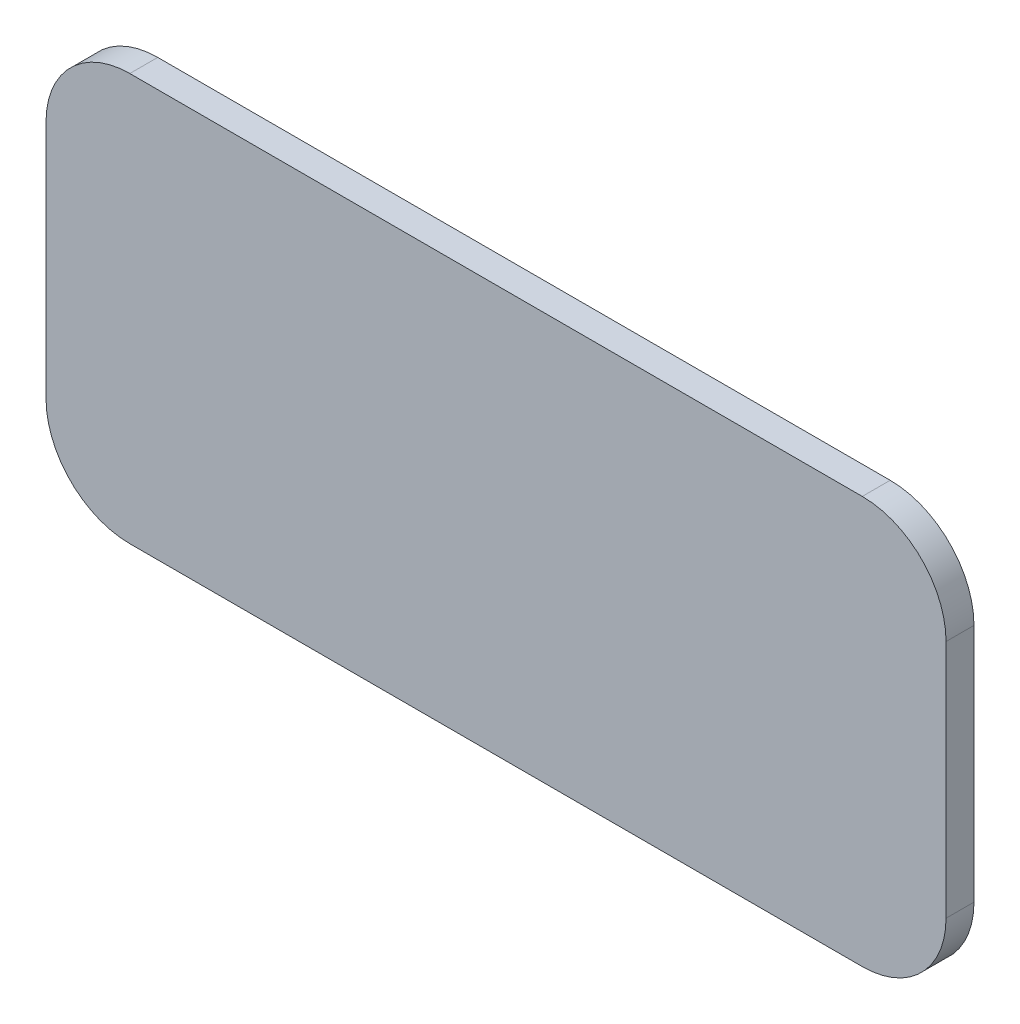
ISO-10303-21;
HEADER;
FILE_DESCRIPTION(('STEP AP214'),'2;1');
FILE_NAME('part.step','',(''),(''),'','','');
FILE_SCHEMA(('AUTOMOTIVE_DESIGN { 1 0 10303 214 1 1 1 1 }'));
ENDSEC;
DATA;
#1=APPLICATION_CONTEXT('core data for automotive mechanical design processes');
#2=APPLICATION_PROTOCOL_DEFINITION('international standard','automotive_design',2000,#1);
#3=PRODUCT_CONTEXT('',#1,'mechanical');
#4=PRODUCT('Part','Part','',(#3));
#5=PRODUCT_RELATED_PRODUCT_CATEGORY('part','',(#4));
#6=PRODUCT_DEFINITION_FORMATION('','',#4);
#7=PRODUCT_DEFINITION_CONTEXT('part definition',#1,'design');
#8=PRODUCT_DEFINITION('design','',#6,#7);
#9=PRODUCT_DEFINITION_SHAPE('','',#8);
#10=(LENGTH_UNIT() NAMED_UNIT(*) SI_UNIT(.MILLI.,.METRE.));
#11=(NAMED_UNIT(*) PLANE_ANGLE_UNIT() SI_UNIT($,.RADIAN.));
#12=(NAMED_UNIT(*) SI_UNIT($,.STERADIAN.) SOLID_ANGLE_UNIT());
#13=UNCERTAINTY_MEASURE_WITH_UNIT(LENGTH_MEASURE(1.E-05),#10,'distance_accuracy_value','');
#14=(GEOMETRIC_REPRESENTATION_CONTEXT(3) GLOBAL_UNCERTAINTY_ASSIGNED_CONTEXT((#13)) GLOBAL_UNIT_ASSIGNED_CONTEXT((#10,
#11,#12)) REPRESENTATION_CONTEXT('',''));
#15=CARTESIAN_POINT('',(0.,0.,0.));
#16=DIRECTION('',(0.,0.,1.));
#17=DIRECTION('',(1.,0.,0.));
#18=AXIS2_PLACEMENT_3D('',#15,#16,#17);
#19=CARTESIAN_POINT('',(-220.35,-17.5,-6.));
#20=DIRECTION('',(0.,0.,1.));
#21=DIRECTION('',(-1.,0.,0.));
#22=AXIS2_PLACEMENT_3D('',#19,#20,#21);
#23=CYLINDRICAL_SURFACE('',#22,18.);
#24=CARTESIAN_POINT('',(-220.35,-17.5,0.));
#25=DIRECTION('',(0.,0.,1.));
#26=DIRECTION('',(-1.,0.,0.));
#27=AXIS2_PLACEMENT_3D('',#24,#25,#26);
#28=CIRCLE('',#27,18.);
#29=CARTESIAN_POINT('',(-238.35,-17.5,0.));
#30=VERTEX_POINT('',#29);
#31=CARTESIAN_POINT('',(-220.35,-35.5,0.));
#32=VERTEX_POINT('',#31);
#33=EDGE_CURVE('E131',#30,#32,#28,.T.);
#34=ORIENTED_EDGE('',*,*,#33,.F.);
#35=DIRECTION('',(0.,0.,1.));
#36=VECTOR('',#35,1.);
#37=CARTESIAN_POINT('',(-238.35,-17.5,-6.));
#38=LINE('',#37,#36);
#39=CARTESIAN_POINT('',(-238.35,-17.5,-6.));
#40=VERTEX_POINT('',#39);
#41=EDGE_CURVE('E130',#40,#30,#38,.T.);
#42=ORIENTED_EDGE('',*,*,#41,.F.);
#43=CARTESIAN_POINT('',(-220.35,-17.5,-6.));
#44=DIRECTION('',(0.,0.,1.));
#45=DIRECTION('',(-1.,0.,0.));
#46=AXIS2_PLACEMENT_3D('',#43,#44,#45);
#47=CIRCLE('',#46,18.);
#48=CARTESIAN_POINT('',(-220.35,-35.5,-6.));
#49=VERTEX_POINT('',#48);
#50=EDGE_CURVE('E149',#40,#49,#47,.T.);
#51=ORIENTED_EDGE('',*,*,#50,.T.);
#52=DIRECTION('',(0.,0.,1.));
#53=VECTOR('',#52,1.);
#54=CARTESIAN_POINT('',(-220.35,-35.5,-6.));
#55=LINE('',#54,#53);
#56=EDGE_CURVE('E11',#49,#32,#55,.T.);
#57=ORIENTED_EDGE('',*,*,#56,.T.);
#58=EDGE_LOOP('',(#34,#42,#51,#57));
#59=FACE_BOUND('',#58,.T.);
#60=ADVANCED_FACE('F35',(#59),#23,.T.);
#61=CARTESIAN_POINT('',(-62.9918118667271,-35.5,-6.));
#62=DIRECTION('',(0.,1.,0.));
#63=DIRECTION('',(-1.,0.,0.));
#64=AXIS2_PLACEMENT_3D('',#61,#62,#63);
#65=PLANE('',#64);
#66=DIRECTION('',(1.,0.,0.));
#67=VECTOR('',#66,1.);
#68=CARTESIAN_POINT('',(-62.9918118667271,-35.5,0.));
#69=LINE('',#68,#67);
#70=CARTESIAN_POINT('',(-62.9918118667271,-35.5,0.));
#71=VERTEX_POINT('',#70);
#72=EDGE_CURVE('E133',#32,#71,#69,.T.);
#73=ORIENTED_EDGE('',*,*,#72,.F.);
#74=ORIENTED_EDGE('',*,*,#56,.F.);
#75=DIRECTION('',(1.,0.,0.));
#76=VECTOR('',#75,1.);
#77=CARTESIAN_POINT('',(-62.9918118667271,-35.5,-6.));
#78=LINE('',#77,#76);
#79=CARTESIAN_POINT('',(-62.9918118667271,-35.5,-6.));
#80=VERTEX_POINT('',#79);
#81=EDGE_CURVE('E89',#49,#80,#78,.T.);
#82=ORIENTED_EDGE('',*,*,#81,.T.);
#83=DIRECTION('',(0.,0.,1.));
#84=VECTOR('',#83,1.);
#85=CARTESIAN_POINT('',(-62.9918118667271,-35.5,-6.));
#86=LINE('',#85,#84);
#87=EDGE_CURVE('E43',#80,#71,#86,.T.);
#88=ORIENTED_EDGE('',*,*,#87,.T.);
#89=EDGE_LOOP('',(#73,#74,#82,#88));
#90=FACE_BOUND('',#89,.T.);
#91=ADVANCED_FACE('F161',(#90),#65,.F.);
#92=CARTESIAN_POINT('',(-62.9918118667271,-17.5,-6.));
#93=DIRECTION('',(0.,0.,1.));
#94=DIRECTION('',(-1.,0.,0.));
#95=AXIS2_PLACEMENT_3D('',#92,#93,#94);
#96=CYLINDRICAL_SURFACE('',#95,18.);
#97=CARTESIAN_POINT('',(-62.9918118667271,-17.5,0.));
#98=DIRECTION('',(0.,0.,1.));
#99=DIRECTION('',(-1.,0.,0.));
#100=AXIS2_PLACEMENT_3D('',#97,#98,#99);
#101=CIRCLE('',#100,18.);
#102=CARTESIAN_POINT('',(-44.9918118667271,-17.5,0.));
#103=VERTEX_POINT('',#102);
#104=EDGE_CURVE('E136',#71,#103,#101,.T.);
#105=ORIENTED_EDGE('',*,*,#104,.F.);
#106=ORIENTED_EDGE('',*,*,#87,.F.);
#107=CARTESIAN_POINT('',(-62.9918118667271,-17.5,-6.));
#108=DIRECTION('',(0.,0.,1.));
#109=DIRECTION('',(-1.,0.,0.));
#110=AXIS2_PLACEMENT_3D('',#107,#108,#109);
#111=CIRCLE('',#110,18.);
#112=CARTESIAN_POINT('',(-44.9918118667271,-17.5,-6.));
#113=VERTEX_POINT('',#112);
#114=EDGE_CURVE('E170',#80,#113,#111,.T.);
#115=ORIENTED_EDGE('',*,*,#114,.T.);
#116=DIRECTION('',(0.,0.,1.));
#117=VECTOR('',#116,1.);
#118=CARTESIAN_POINT('',(-44.9918118667271,-17.5,-6.));
#119=LINE('',#118,#117);
#120=EDGE_CURVE('E156',#113,#103,#119,.T.);
#121=ORIENTED_EDGE('',*,*,#120,.T.);
#122=EDGE_LOOP('',(#105,#106,#115,#121));
#123=FACE_BOUND('',#122,.T.);
#124=ADVANCED_FACE('F180',(#123),#96,.T.);
#125=CARTESIAN_POINT('',(-44.9918118667271,33.9824750795386,-6.));
#126=DIRECTION('',(-1.,0.,0.));
#127=DIRECTION('',(0.,-1.,0.));
#128=AXIS2_PLACEMENT_3D('',#125,#126,#127);
#129=PLANE('',#128);
#130=DIRECTION('',(0.,1.,0.));
#131=VECTOR('',#130,1.);
#132=CARTESIAN_POINT('',(-44.9918118667271,33.9824750795386,0.));
#133=LINE('',#132,#131);
#134=CARTESIAN_POINT('',(-44.9918118667271,33.9824750795386,0.));
#135=VERTEX_POINT('',#134);
#136=EDGE_CURVE('E139',#103,#135,#133,.T.);
#137=ORIENTED_EDGE('',*,*,#136,.F.);
#138=ORIENTED_EDGE('',*,*,#120,.F.);
#139=DIRECTION('',(0.,1.,0.));
#140=VECTOR('',#139,1.);
#141=CARTESIAN_POINT('',(-44.9918118667271,33.9824750795386,-6.));
#142=LINE('',#141,#140);
#143=CARTESIAN_POINT('',(-44.9918118667271,33.9824750795386,-6.));
#144=VERTEX_POINT('',#143);
#145=EDGE_CURVE('E125',#113,#144,#142,.T.);
#146=ORIENTED_EDGE('',*,*,#145,.T.);
#147=DIRECTION('',(0.,0.,1.));
#148=VECTOR('',#147,1.);
#149=CARTESIAN_POINT('',(-44.9918118667271,33.9824750795386,-6.));
#150=LINE('',#149,#148);
#151=EDGE_CURVE('E153',#144,#135,#150,.T.);
#152=ORIENTED_EDGE('',*,*,#151,.T.);
#153=EDGE_LOOP('',(#137,#138,#146,#152));
#154=FACE_BOUND('',#153,.T.);
#155=ADVANCED_FACE('F176',(#154),#129,.F.);
#156=CARTESIAN_POINT('',(-62.9918118667272,33.9824750795385,-6.));
#157=DIRECTION('',(0.,0.,1.));
#158=DIRECTION('',(-1.,0.,0.));
#159=AXIS2_PLACEMENT_3D('',#156,#157,#158);
#160=CYLINDRICAL_SURFACE('',#159,18.0000000000001);
#161=CARTESIAN_POINT('',(-62.9918118667272,33.9824750795385,0.));
#162=DIRECTION('',(0.,0.,1.));
#163=DIRECTION('',(-1.,0.,0.));
#164=AXIS2_PLACEMENT_3D('',#161,#162,#163);
#165=CIRCLE('',#164,18.0000000000001);
#166=CARTESIAN_POINT('',(-62.9918118667272,51.9824750795386,0.));
#167=VERTEX_POINT('',#166);
#168=EDGE_CURVE('E142',#135,#167,#165,.T.);
#169=ORIENTED_EDGE('',*,*,#168,.F.);
#170=ORIENTED_EDGE('',*,*,#151,.F.);
#171=CARTESIAN_POINT('',(-62.9918118667272,33.9824750795385,-6.));
#172=DIRECTION('',(0.,0.,1.));
#173=DIRECTION('',(-1.,0.,0.));
#174=AXIS2_PLACEMENT_3D('',#171,#172,#173);
#175=CIRCLE('',#174,18.0000000000001);
#176=CARTESIAN_POINT('',(-62.9918118667272,51.9824750795386,-6.));
#177=VERTEX_POINT('',#176);
#178=EDGE_CURVE('E123',#144,#177,#175,.T.);
#179=ORIENTED_EDGE('',*,*,#178,.T.);
#180=DIRECTION('',(0.,0.,1.));
#181=VECTOR('',#180,1.);
#182=CARTESIAN_POINT('',(-62.9918118667272,51.9824750795386,-6.));
#183=LINE('',#182,#181);
#184=EDGE_CURVE('E117',#177,#167,#183,.T.);
#185=ORIENTED_EDGE('',*,*,#184,.T.);
#186=EDGE_LOOP('',(#169,#170,#179,#185));
#187=FACE_BOUND('',#186,.T.);
#188=ADVANCED_FACE('F179',(#187),#160,.T.);
#189=CARTESIAN_POINT('',(-220.35,51.9824750795386,-6.));
#190=DIRECTION('',(0.,-1.,0.));
#191=DIRECTION('',(1.,0.,0.));
#192=AXIS2_PLACEMENT_3D('',#189,#190,#191);
#193=PLANE('',#192);
#194=DIRECTION('',(-1.,0.,0.));
#195=VECTOR('',#194,1.);
#196=CARTESIAN_POINT('',(-220.35,51.9824750795386,0.));
#197=LINE('',#196,#195);
#198=CARTESIAN_POINT('',(-220.35,51.9824750795385,0.));
#199=VERTEX_POINT('',#198);
#200=EDGE_CURVE('E145',#167,#199,#197,.T.);
#201=ORIENTED_EDGE('',*,*,#200,.F.);
#202=ORIENTED_EDGE('',*,*,#184,.F.);
#203=DIRECTION('',(-1.,0.,0.));
#204=VECTOR('',#203,1.);
#205=CARTESIAN_POINT('',(-220.35,51.9824750795386,-6.));
#206=LINE('',#205,#204);
#207=CARTESIAN_POINT('',(-220.35,51.9824750795385,-6.));
#208=VERTEX_POINT('',#207);
#209=EDGE_CURVE('E107',#177,#208,#206,.T.);
#210=ORIENTED_EDGE('',*,*,#209,.T.);
#211=DIRECTION('',(0.,0.,1.));
#212=VECTOR('',#211,1.);
#213=CARTESIAN_POINT('',(-220.35,51.9824750795385,-6.));
#214=LINE('',#213,#212);
#215=EDGE_CURVE('E112',#208,#199,#214,.T.);
#216=ORIENTED_EDGE('',*,*,#215,.T.);
#217=EDGE_LOOP('',(#201,#202,#210,#216));
#218=FACE_BOUND('',#217,.T.);
#219=ADVANCED_FACE('F120',(#218),#193,.F.);
#220=CARTESIAN_POINT('',(-220.35,33.9824750795384,-6.));
#221=DIRECTION('',(0.,0.,1.));
#222=DIRECTION('',(-1.,0.,0.));
#223=AXIS2_PLACEMENT_3D('',#220,#221,#222);
#224=CYLINDRICAL_SURFACE('',#223,18.0000000000001);
#225=CARTESIAN_POINT('',(-220.35,33.9824750795384,0.));
#226=DIRECTION('',(0.,0.,1.));
#227=DIRECTION('',(-1.,0.,0.));
#228=AXIS2_PLACEMENT_3D('',#225,#226,#227);
#229=CIRCLE('',#228,18.0000000000001);
#230=CARTESIAN_POINT('',(-238.35,33.9824750795384,0.));
#231=VERTEX_POINT('',#230);
#232=EDGE_CURVE('E114',#199,#231,#229,.T.);
#233=ORIENTED_EDGE('',*,*,#232,.F.);
#234=ORIENTED_EDGE('',*,*,#215,.F.);
#235=CARTESIAN_POINT('',(-220.35,33.9824750795384,-6.));
#236=DIRECTION('',(0.,0.,1.));
#237=DIRECTION('',(-1.,0.,0.));
#238=AXIS2_PLACEMENT_3D('',#235,#236,#237);
#239=CIRCLE('',#238,18.0000000000001);
#240=CARTESIAN_POINT('',(-238.35,33.9824750795384,-6.));
#241=VERTEX_POINT('',#240);
#242=EDGE_CURVE('E103',#208,#241,#239,.T.);
#243=ORIENTED_EDGE('',*,*,#242,.T.);
#244=DIRECTION('',(0.,0.,1.));
#245=VECTOR('',#244,1.);
#246=CARTESIAN_POINT('',(-238.35,33.9824750795384,-6.));
#247=LINE('',#246,#245);
#248=EDGE_CURVE('E118',#241,#231,#247,.T.);
#249=ORIENTED_EDGE('',*,*,#248,.T.);
#250=EDGE_LOOP('',(#233,#234,#243,#249));
#251=FACE_BOUND('',#250,.T.);
#252=ADVANCED_FACE('F113',(#251),#224,.T.);
#253=CARTESIAN_POINT('',(-238.35,-17.5,-6.));
#254=DIRECTION('',(1.,0.,0.));
#255=DIRECTION('',(0.,1.,0.));
#256=AXIS2_PLACEMENT_3D('',#253,#254,#255);
#257=PLANE('',#256);
#258=DIRECTION('',(0.,-1.,0.));
#259=VECTOR('',#258,1.);
#260=CARTESIAN_POINT('',(-238.35,-17.5,0.));
#261=LINE('',#260,#259);
#262=EDGE_CURVE('E77',#231,#30,#261,.T.);
#263=ORIENTED_EDGE('',*,*,#262,.F.);
#264=ORIENTED_EDGE('',*,*,#248,.F.);
#265=DIRECTION('',(0.,-1.,0.));
#266=VECTOR('',#265,1.);
#267=CARTESIAN_POINT('',(-238.35,-17.5,-6.));
#268=LINE('',#267,#266);
#269=EDGE_CURVE('E51',#241,#40,#268,.T.);
#270=ORIENTED_EDGE('',*,*,#269,.T.);
#271=ORIENTED_EDGE('',*,*,#41,.T.);
#272=EDGE_LOOP('',(#263,#264,#270,#271));
#273=FACE_BOUND('',#272,.T.);
#274=ADVANCED_FACE('F230',(#273),#257,.F.);
#275=CARTESIAN_POINT('',(-220.35,-17.5,-6.));
#276=DIRECTION('',(0.,0.,1.));
#277=DIRECTION('',(-1.,0.,0.));
#278=AXIS2_PLACEMENT_3D('',#275,#276,#277);
#279=PLANE('',#278);
#280=ORIENTED_EDGE('',*,*,#50,.F.);
#281=ORIENTED_EDGE('',*,*,#269,.F.);
#282=ORIENTED_EDGE('',*,*,#242,.F.);
#283=ORIENTED_EDGE('',*,*,#209,.F.);
#284=ORIENTED_EDGE('',*,*,#178,.F.);
#285=ORIENTED_EDGE('',*,*,#145,.F.);
#286=ORIENTED_EDGE('',*,*,#114,.F.);
#287=ORIENTED_EDGE('',*,*,#81,.F.);
#288=EDGE_LOOP('',(#280,#281,#282,#283,#284,#285,#286,#287));
#289=FACE_BOUND('',#288,.T.);
#290=ADVANCED_FACE('F105',(#289),#279,.F.);
#291=CARTESIAN_POINT('',(-220.35,-17.5,0.));
#292=DIRECTION('',(0.,0.,1.));
#293=DIRECTION('',(-1.,0.,0.));
#294=AXIS2_PLACEMENT_3D('',#291,#292,#293);
#295=PLANE('',#294);
#296=ORIENTED_EDGE('',*,*,#33,.T.);
#297=ORIENTED_EDGE('',*,*,#72,.T.);
#298=ORIENTED_EDGE('',*,*,#104,.T.);
#299=ORIENTED_EDGE('',*,*,#136,.T.);
#300=ORIENTED_EDGE('',*,*,#168,.T.);
#301=ORIENTED_EDGE('',*,*,#200,.T.);
#302=ORIENTED_EDGE('',*,*,#232,.T.);
#303=ORIENTED_EDGE('',*,*,#262,.T.);
#304=EDGE_LOOP('',(#296,#297,#298,#299,#300,#301,#302,#303));
#305=FACE_BOUND('',#304,.T.);
#306=ADVANCED_FACE('F164',(#305),#295,.T.);
#307=CLOSED_SHELL('',(#60,#91,#124,#155,#188,#219,#252,#274,#290,#306));
#308=MANIFOLD_SOLID_BREP('B2',#307);
#309=ADVANCED_BREP_SHAPE_REPRESENTATION('',(#18,#308),#14);
#310=SHAPE_DEFINITION_REPRESENTATION(#9,#309);
ENDSEC;
END-ISO-10303-21;
